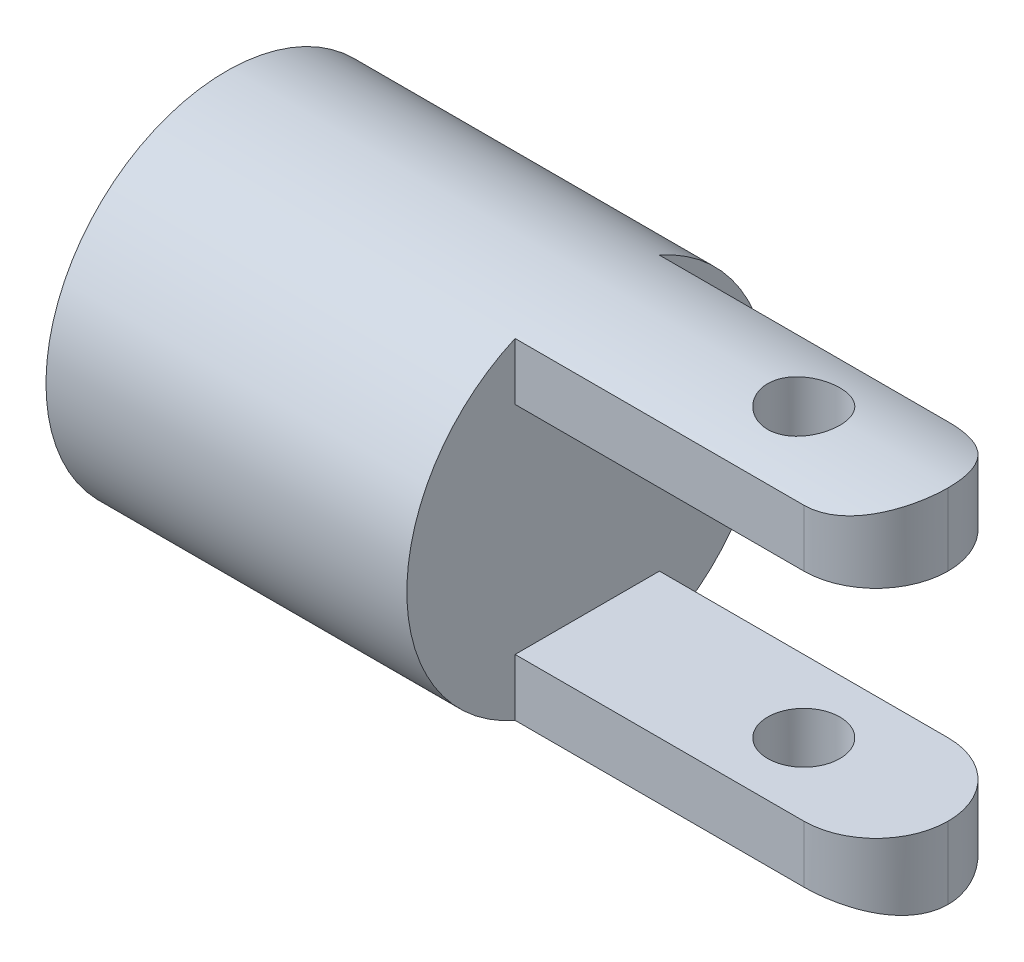
ISO-10303-21;
HEADER;
FILE_DESCRIPTION(('STEP AP214'),'2;1');
FILE_NAME('part.step','',(''),(''),'','','');
FILE_SCHEMA(('AUTOMOTIVE_DESIGN { 1 0 10303 214 1 1 1 1 }'));
ENDSEC;
DATA;
#1=APPLICATION_CONTEXT('core data for automotive mechanical design processes');
#2=APPLICATION_PROTOCOL_DEFINITION('international standard','automotive_design',2000,#1);
#3=PRODUCT_CONTEXT('',#1,'mechanical');
#4=PRODUCT('Part','Part','',(#3));
#5=PRODUCT_RELATED_PRODUCT_CATEGORY('part','',(#4));
#6=PRODUCT_DEFINITION_FORMATION('','',#4);
#7=PRODUCT_DEFINITION_CONTEXT('part definition',#1,'design');
#8=PRODUCT_DEFINITION('design','',#6,#7);
#9=PRODUCT_DEFINITION_SHAPE('','',#8);
#10=(LENGTH_UNIT() NAMED_UNIT(*) SI_UNIT(.MILLI.,.METRE.));
#11=(NAMED_UNIT(*) PLANE_ANGLE_UNIT() SI_UNIT($,.RADIAN.));
#12=(NAMED_UNIT(*) SI_UNIT($,.STERADIAN.) SOLID_ANGLE_UNIT());
#13=UNCERTAINTY_MEASURE_WITH_UNIT(LENGTH_MEASURE(1.E-05),#10,'distance_accuracy_value','');
#14=(GEOMETRIC_REPRESENTATION_CONTEXT(3) GLOBAL_UNCERTAINTY_ASSIGNED_CONTEXT((#13)) GLOBAL_UNIT_ASSIGNED_CONTEXT((#10,
#11,#12)) REPRESENTATION_CONTEXT('',''));
#15=CARTESIAN_POINT('',(0.,0.,0.));
#16=DIRECTION('',(0.,0.,1.));
#17=DIRECTION('',(1.,0.,0.));
#18=AXIS2_PLACEMENT_3D('',#15,#16,#17);
#19=CARTESIAN_POINT('',(10.,0.,0.));
#20=DIRECTION('',(-1.,0.,0.));
#21=DIRECTION('',(0.,0.,1.));
#22=AXIS2_PLACEMENT_3D('',#19,#20,#21);
#23=CYLINDRICAL_SURFACE('',#22,5.);
#24=CARTESIAN_POINT('',(6.,-4.89897948556636,1.));
#25=CARTESIAN_POINT('',(6.05556437548198,-4.89898059043933,0.999997945876046));
#26=CARTESIAN_POINT('',(6.11115462330649,-4.89993508346913,0.995353171723657));
#27=CARTESIAN_POINT('',(6.22076250511841,-4.90364431385263,0.976912283588336));
#28=CARTESIAN_POINT('',(6.27477884463107,-4.90640049166333,0.963108847071182));
#29=CARTESIAN_POINT('',(6.37963730336293,-4.91338873700356,0.926795782617738));
#30=CARTESIAN_POINT('',(6.43048252153493,-4.91761933615313,0.904294814152083));
#31=CARTESIAN_POINT('',(6.52767484469462,-4.92707799486421,0.851249107671044));
#32=CARTESIAN_POINT('',(6.57402220053727,-4.93230599875014,0.820704818601296));
#33=CARTESIAN_POINT('',(6.6615610038545,-4.9432529969268,0.75197907565329));
#34=CARTESIAN_POINT('',(6.70267958788414,-4.94897737836825,0.713705655913279));
#35=CARTESIAN_POINT('',(6.77795753357881,-4.9602247230302,0.63080678902135));
#36=CARTESIAN_POINT('',(6.81211640741715,-4.96574767210945,0.586180896977995));
#37=CARTESIAN_POINT('',(6.87278801762851,-4.97602796417448,0.491361355924245));
#38=CARTESIAN_POINT('',(6.89923151381665,-4.9807782144152,0.441122567672208));
#39=CARTESIAN_POINT('',(6.94327493704813,-4.98891736883662,0.336804150387275));
#40=CARTESIAN_POINT('',(6.96087569190099,-4.99230640044127,0.282724881420554));
#41=CARTESIAN_POINT('',(6.98650719361963,-4.9973032068841,0.173016773278493));
#42=CARTESIAN_POINT('',(6.99466097757101,-4.99893386288125,0.117417739214814));
#43=CARTESIAN_POINT('',(7.00155095183832,-5.00030921183606,0.00561856843753658));
#44=CARTESIAN_POINT('',(7.00028804964582,-5.00005408652759,-0.050581509831843));
#45=CARTESIAN_POINT('',(6.98847381978445,-4.99770434868515,-0.161142000743589));
#46=CARTESIAN_POINT('',(6.97805502283215,-4.99563598365838,-0.21551721429847));
#47=CARTESIAN_POINT('',(6.94843496754111,-4.98992177159409,-0.321731626580301));
#48=CARTESIAN_POINT('',(6.92923335780813,-4.98627586144039,-0.373570723747129));
#49=CARTESIAN_POINT('',(6.88246995985273,-4.97777296019958,-0.473619463200888));
#50=CARTESIAN_POINT('',(6.85485624889511,-4.97290848175223,-0.5218041741339));
#51=CARTESIAN_POINT('',(6.7920909227634,-4.96250469473785,-0.612905045859756));
#52=CARTESIAN_POINT('',(6.75693844022948,-4.95696530855222,-0.655820599525001));
#53=CARTESIAN_POINT('',(6.67936637789153,-4.9457096436446,-0.735951431053458));
#54=CARTESIAN_POINT('',(6.63683081327041,-4.93999196457516,-0.773054316573632));
#55=CARTESIAN_POINT('',(6.54608355754925,-4.92911571598761,-0.839618493176808));
#56=CARTESIAN_POINT('',(6.4978717591168,-4.92395715704548,-0.869079639727751));
#57=CARTESIAN_POINT('',(6.39697916817819,-4.91478047472924,-0.919562814801882));
#58=CARTESIAN_POINT('',(6.34428903236034,-4.91076481563549,-0.94056664777771));
#59=CARTESIAN_POINT('',(6.23602867627601,-4.90436476321273,-0.973390341627583));
#60=CARTESIAN_POINT('',(6.18045883238092,-4.90198015728428,-0.985211399456643));
#61=CARTESIAN_POINT('',(6.06903514200096,-4.89915479267828,-0.999166006036052));
#62=CARTESIAN_POINT('',(6.01320242568966,-4.89868147057154,-1.00146185889791));
#63=CARTESIAN_POINT('',(5.90195177680032,-4.89964485688854,-0.996737628310739));
#64=CARTESIAN_POINT('',(5.84653382088114,-4.90108145700388,-0.989718073122443));
#65=CARTESIAN_POINT('',(5.73823135970776,-4.90567232494914,-0.966702208074158));
#66=CARTESIAN_POINT('',(5.68532765696424,-4.90880999014497,-0.950792620839299));
#67=CARTESIAN_POINT('',(5.58293672097126,-4.91643489351665,-0.910541035308518));
#68=CARTESIAN_POINT('',(5.53344976956428,-4.9209222428627,-0.886198342373178));
#69=CARTESIAN_POINT('',(5.43858689004984,-4.93081405962039,-0.829404142215599));
#70=CARTESIAN_POINT('',(5.39327295369917,-4.93622971864903,-0.796851077982755));
#71=CARTESIAN_POINT('',(5.30869168799908,-4.94733723826636,-0.724695572212713));
#72=CARTESIAN_POINT('',(5.26942498175074,-4.95302912723818,-0.685092405144538));
#73=CARTESIAN_POINT('',(5.19743744081442,-4.96415345869216,-0.599232273497891));
#74=CARTESIAN_POINT('',(5.16482634535,-4.96958057708684,-0.55288249892963));
#75=CARTESIAN_POINT('',(5.10785411850042,-4.9794712762862,-0.455267896634756));
#76=CARTESIAN_POINT('',(5.08349264065522,-4.98393489755211,-0.404003275433507));
#77=CARTESIAN_POINT('',(5.04387112825337,-4.99137294061067,-0.298302680824013));
#78=CARTESIAN_POINT('',(5.02855948177375,-4.99435579142604,-0.243886673478078));
#79=CARTESIAN_POINT('',(5.00730875233615,-4.9985323593766,-0.133189454679912));
#80=CARTESIAN_POINT('',(5.00136854052432,-4.99972629199843,-0.0769084687112141));
#81=CARTESIAN_POINT('',(4.99907301903711,-5.00018540454121,0.0348728939036233));
#82=CARTESIAN_POINT('',(5.00255271954379,-4.99948378549351,0.0903698121415024));
#83=CARTESIAN_POINT('',(5.01863395054781,-4.99630043560318,0.199971031315642));
#84=CARTESIAN_POINT('',(5.03123536634807,-4.99381872714351,0.254075349753691));
#85=CARTESIAN_POINT('',(5.06512899209164,-4.98735498365001,0.359252749745096));
#86=CARTESIAN_POINT('',(5.08640137813118,-4.98337637247912,0.410332443240281));
#87=CARTESIAN_POINT('',(5.1370122413309,-4.97434722123382,0.508221220185953));
#88=CARTESIAN_POINT('',(5.16635135590372,-4.96929659645878,0.555029965767411));
#89=CARTESIAN_POINT('',(5.23281938706208,-4.95857599157868,0.643863890106357));
#90=CARTESIAN_POINT('',(5.27006633638677,-4.95289733422142,0.685799716116503));
#91=CARTESIAN_POINT('',(5.35105024009577,-4.94161222903622,0.762882617756846));
#92=CARTESIAN_POINT('',(5.39478872946874,-4.93600579862875,0.798028083202712));
#93=CARTESIAN_POINT('',(5.48807931670018,-4.92543342749964,0.860892219455201));
#94=CARTESIAN_POINT('',(5.53768896116037,-4.92047503631328,0.888526814639767));
#95=CARTESIAN_POINT('',(5.64093277329969,-4.91185237184445,0.935024049287809));
#96=CARTESIAN_POINT('',(5.69456323869792,-4.90818692536957,0.953894645979291));
#97=CARTESIAN_POINT('',(5.79026245543657,-4.90329681128922,0.978669139854274));
#98=CARTESIAN_POINT('',(5.83178541951146,-4.90168784915661,0.986653898522986));
#99=CARTESIAN_POINT('',(5.91553395455364,-4.8995287845803,0.99732001796041));
#100=CARTESIAN_POINT('',(5.95775950124817,-4.89897864563277,1.00000156156206));
#101=CARTESIAN_POINT('',(6.,-4.89897948556636,1.));
#102=B_SPLINE_CURVE_WITH_KNOTS('',3,(#24,#25,#26,#27,#28,#29,#30,#31,#32,#33,#34,#35,#36,#37,
#38,#39,#40,#41,#42,#43,#44,#45,#46,#47,#48,#49,#50,#51,#52,#53,#54,#55,#56,#57,#58,#59,#60,#61,
#62,#63,#64,#65,#66,#67,#68,#69,#70,#71,#72,#73,#74,#75,#76,#77,#78,#79,#80,#81,#82,#83,#84,#85,
#86,#87,#88,#89,#90,#91,#92,#93,#94,#95,#96,#97,#98,#99,#100,#101),.UNSPECIFIED.,.T.,.F.,(4,2,2,
2,2,2,2,2,2,2,2,2,2,2,2,2,2,2,2,2,2,2,2,2,2,2,2,2,2,2,2,2,2,2,2,2,2,2,4),(0.,0.166538463856524,
0.333210239259265,0.499716497915554,0.666213464834832,0.834822525459335,1.00344340032919,
1.17353400434947,1.34360868244057,1.51144248880577,1.67926012113745,1.84468789631034,
2.01012229071247,2.176599242198,2.34309535767563,2.5124934675998,2.68189478120217,
2.85165863170274,3.02140035013522,3.18823757802091,3.35506534525919,3.52029341780816,
3.68553510351895,3.85293059772018,4.02034332867706,4.19032601730948,4.36030156627602,
4.52929813576147,4.69827434689125,4.86431017412183,5.03034391364254,5.19600017072949,
5.36166952132181,5.53001152023094,5.69839338887278,5.86858898576538,6.0386297508643,
6.16523803634393,6.29184195681712),.UNSPECIFIED.);
#103=CARTESIAN_POINT('',(6.,-4.89897948556636,1.));
#104=VERTEX_POINT('',#103);
#105=EDGE_CURVE('E167',#104,#104,#102,.T.);
#106=ORIENTED_EDGE('',*,*,#105,.T.);
#107=EDGE_LOOP('',(#106));
#108=FACE_BOUND('',#107,.T.);
#109=CARTESIAN_POINT('',(6.,4.89897948556636,1.));
#110=CARTESIAN_POINT('',(5.94443562451802,4.89898059043933,0.999997945876046));
#111=CARTESIAN_POINT('',(5.88884537669351,4.89993508346913,0.995353171723657));
#112=CARTESIAN_POINT('',(5.77923749488159,4.90364431385263,0.976912283588336));
#113=CARTESIAN_POINT('',(5.72522115536893,4.90640049166333,0.963108847071182));
#114=CARTESIAN_POINT('',(5.62036269663707,4.91338873700356,0.926795782617738));
#115=CARTESIAN_POINT('',(5.56951747846507,4.91761933615313,0.904294814152083));
#116=CARTESIAN_POINT('',(5.47232515530538,4.92707799486421,0.851249107671044));
#117=CARTESIAN_POINT('',(5.42597779946273,4.93230599875014,0.820704818601296));
#118=CARTESIAN_POINT('',(5.3384389961455,4.9432529969268,0.75197907565329));
#119=CARTESIAN_POINT('',(5.29732041211586,4.94897737836825,0.713705655913279));
#120=CARTESIAN_POINT('',(5.22204246642119,4.9602247230302,0.63080678902135));
#121=CARTESIAN_POINT('',(5.18788359258285,4.96574767210945,0.586180896977995));
#122=CARTESIAN_POINT('',(5.12721198237149,4.97602796417448,0.491361355924245));
#123=CARTESIAN_POINT('',(5.10076848618335,4.9807782144152,0.441122567672208));
#124=CARTESIAN_POINT('',(5.05672506295187,4.98891736883662,0.336804150387275));
#125=CARTESIAN_POINT('',(5.03912430809901,4.99230640044127,0.282724881420554));
#126=CARTESIAN_POINT('',(5.01349280638037,4.9973032068841,0.173016773278494));
#127=CARTESIAN_POINT('',(5.00533902242899,4.99893386288125,0.117417739214814));
#128=CARTESIAN_POINT('',(4.99844904816169,5.00030921183606,0.00561856843753661));
#129=CARTESIAN_POINT('',(4.99971195035418,5.00005408652759,-0.050581509831843));
#130=CARTESIAN_POINT('',(5.01152618021555,4.99770434868515,-0.161142000743589));
#131=CARTESIAN_POINT('',(5.02194497716785,4.99563598365838,-0.21551721429847));
#132=CARTESIAN_POINT('',(5.05156503245889,4.98992177159409,-0.321731626580301));
#133=CARTESIAN_POINT('',(5.07076664219187,4.98627586144039,-0.373570723747129));
#134=CARTESIAN_POINT('',(5.11753004014727,4.97777296019958,-0.473619463200888));
#135=CARTESIAN_POINT('',(5.14514375110489,4.97290848175223,-0.5218041741339));
#136=CARTESIAN_POINT('',(5.2079090772366,4.96250469473785,-0.612905045859756));
#137=CARTESIAN_POINT('',(5.24306155977052,4.95696530855222,-0.655820599525001));
#138=CARTESIAN_POINT('',(5.32063362210847,4.9457096436446,-0.735951431053458));
#139=CARTESIAN_POINT('',(5.36316918672959,4.93999196457516,-0.773054316573632));
#140=CARTESIAN_POINT('',(5.45391644245075,4.92911571598761,-0.839618493176808));
#141=CARTESIAN_POINT('',(5.5021282408832,4.92395715704548,-0.869079639727751));
#142=CARTESIAN_POINT('',(5.60302083182181,4.91478047472924,-0.919562814801882));
#143=CARTESIAN_POINT('',(5.65571096763966,4.91076481563549,-0.94056664777771));
#144=CARTESIAN_POINT('',(5.76397132372399,4.90436476321273,-0.973390341627583));
#145=CARTESIAN_POINT('',(5.81954116761908,4.90198015728428,-0.985211399456643));
#146=CARTESIAN_POINT('',(5.93096485799904,4.89915479267828,-0.999166006036052));
#147=CARTESIAN_POINT('',(5.98679757431034,4.89868147057154,-1.00146185889791));
#148=CARTESIAN_POINT('',(6.09804822319968,4.89964485688854,-0.996737628310739));
#149=CARTESIAN_POINT('',(6.15346617911886,4.90108145700388,-0.989718073122443));
#150=CARTESIAN_POINT('',(6.26176864029224,4.90567232494914,-0.966702208074158));
#151=CARTESIAN_POINT('',(6.31467234303576,4.90880999014497,-0.950792620839299));
#152=CARTESIAN_POINT('',(6.41706327902874,4.91643489351665,-0.910541035308518));
#153=CARTESIAN_POINT('',(6.46655023043572,4.9209222428627,-0.886198342373178));
#154=CARTESIAN_POINT('',(6.56141310995016,4.93081405962039,-0.829404142215599));
#155=CARTESIAN_POINT('',(6.60672704630083,4.93622971864903,-0.796851077982755));
#156=CARTESIAN_POINT('',(6.69130831200092,4.94733723826636,-0.724695572212713));
#157=CARTESIAN_POINT('',(6.73057501824926,4.95302912723818,-0.685092405144538));
#158=CARTESIAN_POINT('',(6.80256255918558,4.96415345869216,-0.599232273497891));
#159=CARTESIAN_POINT('',(6.83517365465,4.96958057708684,-0.55288249892963));
#160=CARTESIAN_POINT('',(6.89214588149958,4.9794712762862,-0.455267896634755));
#161=CARTESIAN_POINT('',(6.91650735934478,4.98393489755211,-0.404003275433507));
#162=CARTESIAN_POINT('',(6.95612887174663,4.99137294061067,-0.298302680824013));
#163=CARTESIAN_POINT('',(6.97144051822625,4.99435579142604,-0.243886673478078));
#164=CARTESIAN_POINT('',(6.99269124766385,4.9985323593766,-0.133189454679912));
#165=CARTESIAN_POINT('',(6.99863145947568,4.99972629199843,-0.0769084687112142));
#166=CARTESIAN_POINT('',(7.00092698096289,5.00018540454121,0.0348728939036233));
#167=CARTESIAN_POINT('',(6.99744728045621,4.99948378549351,0.0903698121415024));
#168=CARTESIAN_POINT('',(6.98136604945219,4.99630043560318,0.199971031315642));
#169=CARTESIAN_POINT('',(6.96876463365193,4.99381872714351,0.254075349753691));
#170=CARTESIAN_POINT('',(6.93487100790836,4.98735498365001,0.359252749745096));
#171=CARTESIAN_POINT('',(6.91359862186882,4.98337637247912,0.410332443240281));
#172=CARTESIAN_POINT('',(6.8629877586691,4.97434722123382,0.508221220185953));
#173=CARTESIAN_POINT('',(6.83364864409628,4.96929659645878,0.555029965767411));
#174=CARTESIAN_POINT('',(6.76718061293792,4.95857599157868,0.643863890106357));
#175=CARTESIAN_POINT('',(6.72993366361323,4.95289733422142,0.685799716116503));
#176=CARTESIAN_POINT('',(6.64894975990423,4.94161222903622,0.762882617756846));
#177=CARTESIAN_POINT('',(6.60521127053126,4.93600579862875,0.798028083202712));
#178=CARTESIAN_POINT('',(6.51192068329982,4.92543342749964,0.8608922194552));
#179=CARTESIAN_POINT('',(6.46231103883964,4.92047503631328,0.888526814639767));
#180=CARTESIAN_POINT('',(6.35906722670031,4.91185237184445,0.935024049287809));
#181=CARTESIAN_POINT('',(6.30543676130208,4.90818692536957,0.95389464597929));
#182=CARTESIAN_POINT('',(6.20973754456343,4.90329681128922,0.978669139854274));
#183=CARTESIAN_POINT('',(6.16821458048855,4.90168784915661,0.986653898522986));
#184=CARTESIAN_POINT('',(6.08446604544636,4.8995287845803,0.99732001796041));
#185=CARTESIAN_POINT('',(6.04224049875183,4.89897864563277,1.00000156156206));
#186=CARTESIAN_POINT('',(6.,4.89897948556636,1.));
#187=B_SPLINE_CURVE_WITH_KNOTS('',3,(#109,#110,#111,#112,#113,#114,#115,#116,#117,#118,#119,
#120,#121,#122,#123,#124,#125,#126,#127,#128,#129,#130,#131,#132,#133,#134,#135,#136,#137,#138,
#139,#140,#141,#142,#143,#144,#145,#146,#147,#148,#149,#150,#151,#152,#153,#154,#155,#156,#157,
#158,#159,#160,#161,#162,#163,#164,#165,#166,#167,#168,#169,#170,#171,#172,#173,#174,#175,#176,
#177,#178,#179,#180,#181,#182,#183,#184,#185,#186),.UNSPECIFIED.,.T.,.F.,(4,2,2,2,2,2,2,2,2,2,2,
2,2,2,2,2,2,2,2,2,2,2,2,2,2,2,2,2,2,2,2,2,2,2,2,2,2,2,4),(0.,0.166538463856524,
0.333210239259265,0.499716497915554,0.666213464834832,0.834822525459335,1.00344340032919,
1.17353400434947,1.34360868244057,1.51144248880577,1.67926012113745,1.84468789631034,
2.01012229071247,2.176599242198,2.34309535767563,2.5124934675998,2.68189478120217,
2.85165863170274,3.02140035013522,3.18823757802091,3.35506534525919,3.52029341780816,
3.68553510351895,3.85293059772018,4.02034332867706,4.19032601730948,4.36030156627602,
4.52929813576147,4.69827434689125,4.86431017412183,5.03034391364254,5.19600017072949,
5.36166952132181,5.53001152023094,5.69839338887278,5.86858898576538,6.0386297508643,
6.16523803634393,6.29184195681712),.UNSPECIFIED.);
#188=CARTESIAN_POINT('',(6.,4.89897948556636,1.));
#189=VERTEX_POINT('',#188);
#190=EDGE_CURVE('E160',#189,#189,#187,.T.);
#191=ORIENTED_EDGE('',*,*,#190,.T.);
#192=EDGE_LOOP('',(#191));
#193=FACE_BOUND('',#192,.T.);
#194=DIRECTION('',(-1.,0.,0.));
#195=VECTOR('',#194,1.);
#196=CARTESIAN_POINT('',(10.,-4.58257569495584,-2.));
#197=LINE('',#196,#195);
#198=CARTESIAN_POINT('',(0.,-4.58257569495584,-2.));
#199=VERTEX_POINT('',#198);
#200=CARTESIAN_POINT('',(8.,-4.58257569495584,-2.));
#201=VERTEX_POINT('',#200);
#202=EDGE_CURVE('E152',#199,#201,#197,.F.);
#203=ORIENTED_EDGE('',*,*,#202,.T.);
#204=CARTESIAN_POINT('',(8.,-4.58257569495584,-2.));
#205=CARTESIAN_POINT('',(8.05380794672207,-4.58256464275298,-2.00000798226547));
#206=CARTESIAN_POINT('',(8.10760985512743,-4.58352313442188,-1.99782874490323));
#207=CARTESIAN_POINT('',(8.21477962167183,-4.5872966203973,-1.98915821670635));
#208=CARTESIAN_POINT('',(8.26814763735034,-4.5901109073494,-1.98266856881979));
#209=CARTESIAN_POINT('',(8.37385705447567,-4.59749868539403,-1.96547403396094));
#210=CARTESIAN_POINT('',(8.42620171249594,-4.60206508273537,-1.95478614029394));
#211=CARTESIAN_POINT('',(8.52970476915836,-4.61280101528185,-1.92931514556297));
#212=CARTESIAN_POINT('',(8.58086309526334,-4.6189706482353,-1.91453179479781));
#213=CARTESIAN_POINT('',(8.73193384815239,-4.63959263808194,-1.86427039137914));
#214=CARTESIAN_POINT('',(8.82965033430428,-4.65617382537423,-1.82284658382869));
#215=CARTESIAN_POINT('',(9.01679203128369,-4.69312290325746,-1.72548410131523));
#216=CARTESIAN_POINT('',(9.10620891287759,-4.71349453753741,-1.66953105454032));
#217=CARTESIAN_POINT('',(9.27926132355672,-4.75700971229099,-1.5413192827261));
#218=CARTESIAN_POINT('',(9.36236512614559,-4.78024183177243,-1.46837145068181));
#219=CARTESIAN_POINT('',(9.51553876313595,-4.82612745066481,-1.30969788005014));
#220=CARTESIAN_POINT('',(9.58560561543521,-4.84878081667053,-1.22396922600595));
#221=CARTESIAN_POINT('',(9.71342935616949,-4.89204182066139,-1.03797402696559));
#222=CARTESIAN_POINT('',(9.77058398128806,-4.91253186687149,-0.937264095137756));
#223=CARTESIAN_POINT('',(9.86687467110571,-4.94805155705439,-0.726735487214705));
#224=CARTESIAN_POINT('',(9.90603118484789,-4.96308739385852,-0.616927316658774));
#225=CARTESIAN_POINT('',(9.95673922691488,-4.98281366909797,-0.422308681432875));
#226=CARTESIAN_POINT('',(9.97290672820058,-4.98920714607479,-0.338847141215359));
#227=CARTESIAN_POINT('',(9.99455968296722,-4.9978239365109,-0.170279893555539));
#228=CARTESIAN_POINT('',(10.0000371714556,-5.00004414047217,-0.085173007830922));
#229=CARTESIAN_POINT('',(10.,-5.,0.));
#230=B_SPLINE_CURVE_WITH_KNOTS('',3,(#204,#205,#206,#207,#208,#209,#210,#211,#212,#213,#214,
#215,#216,#217,#218,#219,#220,#221,#222,#223,#224,#225,#226,#227,#228,#229),.UNSPECIFIED.,.F.,
.F.,(4,2,2,2,2,2,2,2,2,2,2,2,4),(0.,0.161361132218348,0.322660795595021,0.483314182470726,
0.643977366585654,0.964676637786452,1.28569434990803,1.62317652692535,1.96073580574917,
2.31175518758891,2.6623747573584,2.91738155220578,3.17257827694264),.UNSPECIFIED.);
#231=CARTESIAN_POINT('',(10.,-5.,0.));
#232=VERTEX_POINT('',#231);
#233=EDGE_CURVE('E248',#201,#232,#230,.T.);
#234=ORIENTED_EDGE('',*,*,#233,.T.);
#235=CARTESIAN_POINT('',(10.,-5.,0.));
#236=CARTESIAN_POINT('',(10.0000075778829,-5.00000805896568,0.0539825664563211));
#237=CARTESIAN_POINT('',(9.99781459055665,-4.99912596417449,0.107960110320674));
#238=CARTESIAN_POINT('',(9.98908634175755,-4.9956416195171,0.215491525692988));
#239=CARTESIAN_POINT('',(9.98255236713993,-4.99303987942887,0.269045518000412));
#240=CARTESIAN_POINT('',(9.96523130012006,-4.98618834146238,0.375162640014686));
#241=CARTESIAN_POINT('',(9.95445917326855,-4.98194434350163,0.427728581646533));
#242=CARTESIAN_POINT('',(9.92877901672999,-4.97192620219359,0.531678089194856));
#243=CARTESIAN_POINT('',(9.91387082146321,-4.96615199758777,0.583061607686043));
#244=CARTESIAN_POINT('',(9.86315734027571,-4.94675280678146,0.734842037962944));
#245=CARTESIAN_POINT('',(9.82133521708571,-4.93103965584297,0.833037602437025));
#246=CARTESIAN_POINT('',(9.72303888046503,-4.89558681296197,1.02098836831291));
#247=CARTESIAN_POINT('',(9.66655370578164,-4.87584411112944,1.11073718673261));
#248=CARTESIAN_POINT('',(9.53776410630983,-4.83330860764966,1.2834989710368));
#249=CARTESIAN_POINT('',(9.46489060274242,-4.8104219882134,1.36606513383557));
#250=CARTESIAN_POINT('',(9.30659481549411,-4.76460445713638,1.51817975582642));
#251=CARTESIAN_POINT('',(9.22116705158954,-4.74167353049049,1.58772249969095));
#252=CARTESIAN_POINT('',(9.03553131361565,-4.69721798262516,1.71490322313788));
#253=CARTESIAN_POINT('',(8.93483118065825,-4.67580310017044,1.77186456014057));
#254=CARTESIAN_POINT('',(8.72435381541352,-4.63832030094516,1.86779273517168));
#255=CARTESIAN_POINT('',(8.61458934130171,-4.62224502353331,1.90678437340489));
#256=CARTESIAN_POINT('',(8.42039615622961,-4.60110694265762,1.95713070702437));
#257=CARTESIAN_POINT('',(8.33734865687763,-4.59422849336489,1.97314512573215));
#258=CARTESIAN_POINT('',(8.16956037832453,-4.58493031504587,1.99460528633617));
#259=CARTESIAN_POINT('',(8.08481771370095,-4.58251586581701,2.00003851372961));
#260=CARTESIAN_POINT('',(8.,-4.58257569495584,2.));
#261=B_SPLINE_CURVE_WITH_KNOTS('',3,(#235,#236,#237,#238,#239,#240,#241,#242,#243,#244,#245,
#246,#247,#248,#249,#250,#251,#252,#253,#254,#255,#256,#257,#258,#259,#260),.UNSPECIFIED.,.F.,
.F.,(4,2,2,2,2,2,2,2,2,2,2,2,4),(0.,0.161887516282227,0.323727063545161,0.485000187552343,
0.646279768757658,0.968331009877644,1.2906236947287,1.626578356582,1.96268010840895,
2.31390836587329,2.66465042644721,2.91846381435153,3.17257720854796),.UNSPECIFIED.);
#262=CARTESIAN_POINT('',(8.,-4.58257569495584,2.));
#263=VERTEX_POINT('',#262);
#264=EDGE_CURVE('E118',#232,#263,#261,.T.);
#265=ORIENTED_EDGE('',*,*,#264,.T.);
#266=DIRECTION('',(-1.,0.,0.));
#267=VECTOR('',#266,1.);
#268=CARTESIAN_POINT('',(10.,-4.58257569495584,2.));
#269=LINE('',#268,#267);
#270=CARTESIAN_POINT('',(0.,-4.58257569495584,2.));
#271=VERTEX_POINT('',#270);
#272=EDGE_CURVE('E110',#263,#271,#269,.T.);
#273=ORIENTED_EDGE('',*,*,#272,.T.);
#274=CARTESIAN_POINT('',(0.,0.,0.));
#275=DIRECTION('',(-1.,0.,0.));
#276=DIRECTION('',(0.,0.,1.));
#277=AXIS2_PLACEMENT_3D('',#274,#275,#276);
#278=CIRCLE('',#277,5.);
#279=CARTESIAN_POINT('',(0.,4.58257569495584,2.));
#280=VERTEX_POINT('',#279);
#281=EDGE_CURVE('E115',#271,#280,#278,.T.);
#282=ORIENTED_EDGE('',*,*,#281,.T.);
#283=DIRECTION('',(-1.,0.,0.));
#284=VECTOR('',#283,1.);
#285=CARTESIAN_POINT('',(10.,4.58257569495584,2.));
#286=LINE('',#285,#284);
#287=CARTESIAN_POINT('',(8.,4.58257569495584,2.));
#288=VERTEX_POINT('',#287);
#289=EDGE_CURVE('E123',#280,#288,#286,.F.);
#290=ORIENTED_EDGE('',*,*,#289,.T.);
#291=CARTESIAN_POINT('',(8.,4.58257569495584,2.));
#292=CARTESIAN_POINT('',(8.05380794672207,4.58256464275298,2.00000798226547));
#293=CARTESIAN_POINT('',(8.10760985512743,4.58352313442188,1.99782874490323));
#294=CARTESIAN_POINT('',(8.21477962167183,4.5872966203973,1.98915821670635));
#295=CARTESIAN_POINT('',(8.26814763735034,4.5901109073494,1.98266856881979));
#296=CARTESIAN_POINT('',(8.37385705447567,4.59749868539403,1.96547403396094));
#297=CARTESIAN_POINT('',(8.42620171249594,4.60206508273537,1.95478614029394));
#298=CARTESIAN_POINT('',(8.52970476915836,4.61280101528185,1.92931514556297));
#299=CARTESIAN_POINT('',(8.58086309526334,4.6189706482353,1.91453179479781));
#300=CARTESIAN_POINT('',(8.73193384815239,4.63959263808194,1.86427039137914));
#301=CARTESIAN_POINT('',(8.82965033430428,4.65617382537423,1.82284658382869));
#302=CARTESIAN_POINT('',(9.01679203128369,4.69312290325746,1.72548410131523));
#303=CARTESIAN_POINT('',(9.10620891287759,4.71349453753741,1.66953105454032));
#304=CARTESIAN_POINT('',(9.27926132355672,4.75700971229099,1.5413192827261));
#305=CARTESIAN_POINT('',(9.36236512614559,4.78024183177243,1.4683714506818));
#306=CARTESIAN_POINT('',(9.51553876313595,4.82612745066481,1.30969788005014));
#307=CARTESIAN_POINT('',(9.58560561543521,4.84878081667053,1.22396922600595));
#308=CARTESIAN_POINT('',(9.71342935616949,4.89204182066139,1.03797402696559));
#309=CARTESIAN_POINT('',(9.77058398128806,4.91253186687149,0.937264095137755));
#310=CARTESIAN_POINT('',(9.86687467110571,4.94805155705439,0.726735487214705));
#311=CARTESIAN_POINT('',(9.90603118484789,4.96308739385852,0.616927316658773));
#312=CARTESIAN_POINT('',(9.95673922691488,4.98281366909797,0.422308681432875));
#313=CARTESIAN_POINT('',(9.97290672820058,4.98920714607479,0.338847141215358));
#314=CARTESIAN_POINT('',(9.99455968296722,4.9978239365109,0.170279893555539));
#315=CARTESIAN_POINT('',(10.0000371714556,5.00004414047217,0.0851730078309217));
#316=CARTESIAN_POINT('',(10.,5.,0.));
#317=B_SPLINE_CURVE_WITH_KNOTS('',3,(#291,#292,#293,#294,#295,#296,#297,#298,#299,#300,#301,
#302,#303,#304,#305,#306,#307,#308,#309,#310,#311,#312,#313,#314,#315,#316),.UNSPECIFIED.,.F.,
.F.,(4,2,2,2,2,2,2,2,2,2,2,2,4),(0.,0.161361132218348,0.322660795595021,0.483314182470726,
0.643977366585654,0.964676637786453,1.28569434990803,1.62317652692535,1.96073580574917,
2.31175518758891,2.6623747573584,2.91738155220578,3.17257827694264),.UNSPECIFIED.);
#318=CARTESIAN_POINT('',(10.,5.,0.));
#319=VERTEX_POINT('',#318);
#320=EDGE_CURVE('E220',#288,#319,#317,.T.);
#321=ORIENTED_EDGE('',*,*,#320,.T.);
#322=CARTESIAN_POINT('',(10.,5.,0.));
#323=CARTESIAN_POINT('',(10.0000075778829,5.00000805896568,-0.0539825664563218));
#324=CARTESIAN_POINT('',(9.99781459055665,4.99912596417449,-0.107960110320674));
#325=CARTESIAN_POINT('',(9.98908634175755,4.9956416195171,-0.215491525692989));
#326=CARTESIAN_POINT('',(9.98255236713993,4.99303987942887,-0.269045518000412));
#327=CARTESIAN_POINT('',(9.96523130012006,4.98618834146238,-0.375162640014687));
#328=CARTESIAN_POINT('',(9.95445917326855,4.98194434350163,-0.427728581646533));
#329=CARTESIAN_POINT('',(9.92877901672999,4.97192620219359,-0.531678089194856));
#330=CARTESIAN_POINT('',(9.91387082146321,4.96615199758777,-0.583061607686044));
#331=CARTESIAN_POINT('',(9.86315734027571,4.94675280678146,-0.734842037962944));
#332=CARTESIAN_POINT('',(9.82133521708571,4.93103965584297,-0.833037602437026));
#333=CARTESIAN_POINT('',(9.72303888046503,4.89558681296197,-1.02098836831291));
#334=CARTESIAN_POINT('',(9.66655370578164,4.87584411112944,-1.11073718673261));
#335=CARTESIAN_POINT('',(9.53776410630983,4.83330860764966,-1.2834989710368));
#336=CARTESIAN_POINT('',(9.46489060274242,4.8104219882134,-1.36606513383557));
#337=CARTESIAN_POINT('',(9.30659481549411,4.76460445713637,-1.51817975582642));
#338=CARTESIAN_POINT('',(9.22116705158954,4.74167353049049,-1.58772249969095));
#339=CARTESIAN_POINT('',(9.03553131361565,4.69721798262516,-1.71490322313788));
#340=CARTESIAN_POINT('',(8.93483118065825,4.67580310017044,-1.77186456014057));
#341=CARTESIAN_POINT('',(8.72435381541352,4.63832030094516,-1.86779273517168));
#342=CARTESIAN_POINT('',(8.61458934130171,4.6222450235333,-1.90678437340489));
#343=CARTESIAN_POINT('',(8.42039615622961,4.60110694265762,-1.95713070702437));
#344=CARTESIAN_POINT('',(8.33734865687763,4.59422849336489,-1.97314512573215));
#345=CARTESIAN_POINT('',(8.16956037832453,4.58493031504587,-1.99460528633617));
#346=CARTESIAN_POINT('',(8.08481771370095,4.58251586581702,-2.00003851372961));
#347=CARTESIAN_POINT('',(8.,4.58257569495584,-2.));
#348=B_SPLINE_CURVE_WITH_KNOTS('',3,(#322,#323,#324,#325,#326,#327,#328,#329,#330,#331,#332,
#333,#334,#335,#336,#337,#338,#339,#340,#341,#342,#343,#344,#345,#346,#347),.UNSPECIFIED.,.F.,
.F.,(4,2,2,2,2,2,2,2,2,2,2,2,4),(0.,0.161887516282227,0.323727063545161,0.485000187552343,
0.646279768757658,0.968331009877644,1.2906236947287,1.626578356582,1.96268010840895,
2.31390836587329,2.66465042644721,2.91846381435153,3.17257720854796),.UNSPECIFIED.);
#349=CARTESIAN_POINT('',(8.,4.58257569495584,-2.));
#350=VERTEX_POINT('',#349);
#351=EDGE_CURVE('E225',#319,#350,#348,.T.);
#352=ORIENTED_EDGE('',*,*,#351,.T.);
#353=DIRECTION('',(-1.,0.,0.));
#354=VECTOR('',#353,1.);
#355=CARTESIAN_POINT('',(10.,4.58257569495584,-2.));
#356=LINE('',#355,#354);
#357=CARTESIAN_POINT('',(0.,4.58257569495584,-2.));
#358=VERTEX_POINT('',#357);
#359=EDGE_CURVE('E154',#350,#358,#356,.T.);
#360=ORIENTED_EDGE('',*,*,#359,.T.);
#361=EDGE_CURVE('E135',#358,#199,#278,.T.);
#362=ORIENTED_EDGE('',*,*,#361,.T.);
#363=EDGE_LOOP('',(#203,#234,#265,#273,#282,#290,#321,#352,#360,#362));
#364=FACE_BOUND('',#363,.T.);
#365=CARTESIAN_POINT('',(-10.,0.,0.));
#366=DIRECTION('',(1.,0.,0.));
#367=DIRECTION('',(0.,0.,-1.));
#368=AXIS2_PLACEMENT_3D('',#365,#366,#367);
#369=CIRCLE('',#368,5.);
#370=CARTESIAN_POINT('',(-10.,0.,-5.));
#371=VERTEX_POINT('',#370);
#372=EDGE_CURVE('E136',#371,#371,#369,.T.);
#373=ORIENTED_EDGE('',*,*,#372,.T.);
#374=EDGE_LOOP('',(#373));
#375=FACE_BOUND('',#374,.T.);
#376=ADVANCED_FACE('F35',(#108,#193,#364,#375),#23,.T.);
#377=CARTESIAN_POINT('',(-10.,0.,0.));
#378=DIRECTION('',(1.,0.,0.));
#379=DIRECTION('',(0.,0.,-1.));
#380=AXIS2_PLACEMENT_3D('',#377,#378,#379);
#381=PLANE('',#380);
#382=ORIENTED_EDGE('',*,*,#372,.F.);
#383=EDGE_LOOP('',(#382));
#384=FACE_BOUND('',#383,.T.);
#385=ADVANCED_FACE('F193',(#384),#381,.F.);
#386=CARTESIAN_POINT('',(0.,3.,-5.));
#387=DIRECTION('',(-1.,0.,0.));
#388=DIRECTION('',(0.,0.,1.));
#389=AXIS2_PLACEMENT_3D('',#386,#387,#388);
#390=PLANE('',#389);
#391=DIRECTION('',(0.,0.,1.));
#392=VECTOR('',#391,1.);
#393=CARTESIAN_POINT('',(0.,3.,-5.));
#394=LINE('',#393,#392);
#395=CARTESIAN_POINT('',(0.,3.,-2.));
#396=VERTEX_POINT('',#395);
#397=CARTESIAN_POINT('',(0.,3.,2.));
#398=VERTEX_POINT('',#397);
#399=EDGE_CURVE('E203',#396,#398,#394,.T.);
#400=ORIENTED_EDGE('',*,*,#399,.T.);
#401=DIRECTION('',(0.,1.,0.));
#402=VECTOR('',#401,1.);
#403=CARTESIAN_POINT('',(0.,-5.,2.));
#404=LINE('',#403,#402);
#405=EDGE_CURVE('E134',#398,#280,#404,.T.);
#406=ORIENTED_EDGE('',*,*,#405,.T.);
#407=ORIENTED_EDGE('',*,*,#281,.F.);
#408=CARTESIAN_POINT('',(0.,-3.,2.));
#409=VERTEX_POINT('',#408);
#410=EDGE_CURVE('E131',#271,#409,#404,.T.);
#411=ORIENTED_EDGE('',*,*,#410,.T.);
#412=DIRECTION('',(0.,0.,1.));
#413=VECTOR('',#412,1.);
#414=CARTESIAN_POINT('',(0.,-3.,-5.));
#415=LINE('',#414,#413);
#416=CARTESIAN_POINT('',(0.,-3.,-2.));
#417=VERTEX_POINT('',#416);
#418=EDGE_CURVE('E205',#417,#409,#415,.T.);
#419=ORIENTED_EDGE('',*,*,#418,.F.);
#420=DIRECTION('',(0.,1.,0.));
#421=VECTOR('',#420,1.);
#422=CARTESIAN_POINT('',(0.,-5.,-2.));
#423=LINE('',#422,#421);
#424=EDGE_CURVE('E149',#199,#417,#423,.T.);
#425=ORIENTED_EDGE('',*,*,#424,.F.);
#426=ORIENTED_EDGE('',*,*,#361,.F.);
#427=EDGE_CURVE('E122',#396,#358,#423,.T.);
#428=ORIENTED_EDGE('',*,*,#427,.F.);
#429=EDGE_LOOP('',(#400,#406,#407,#411,#419,#425,#426,#428));
#430=FACE_BOUND('',#429,.T.);
#431=ADVANCED_FACE('F129',(#430),#390,.F.);
#432=CARTESIAN_POINT('',(0.,3.,-5.));
#433=DIRECTION('',(0.,1.,0.));
#434=DIRECTION('',(0.,0.,1.));
#435=AXIS2_PLACEMENT_3D('',#432,#433,#434);
#436=PLANE('',#435);
#437=CARTESIAN_POINT('',(6.,3.,0.));
#438=DIRECTION('',(0.,1.,0.));
#439=DIRECTION('',(0.,0.,1.));
#440=AXIS2_PLACEMENT_3D('',#437,#438,#439);
#441=CIRCLE('',#440,1.);
#442=CARTESIAN_POINT('',(6.,3.,1.));
#443=VERTEX_POINT('',#442);
#444=EDGE_CURVE('E157',#443,#443,#441,.T.);
#445=ORIENTED_EDGE('',*,*,#444,.T.);
#446=EDGE_LOOP('',(#445));
#447=FACE_BOUND('',#446,.T.);
#448=DIRECTION('',(1.,0.,0.));
#449=VECTOR('',#448,1.);
#450=CARTESIAN_POINT('',(0.,3.,-2.));
#451=LINE('',#450,#449);
#452=CARTESIAN_POINT('',(8.,3.,-2.));
#453=VERTEX_POINT('',#452);
#454=EDGE_CURVE('E150',#396,#453,#451,.T.);
#455=ORIENTED_EDGE('',*,*,#454,.T.);
#456=CARTESIAN_POINT('',(8.,3.,0.));
#457=DIRECTION('',(0.,1.,0.));
#458=DIRECTION('',(0.,0.,1.));
#459=AXIS2_PLACEMENT_3D('',#456,#457,#458);
#460=CIRCLE('',#459,2.);
#461=CARTESIAN_POINT('',(10.,3.,0.));
#462=VERTEX_POINT('',#461);
#463=EDGE_CURVE('E45',#453,#462,#460,.F.);
#464=ORIENTED_EDGE('',*,*,#463,.T.);
#465=CARTESIAN_POINT('',(8.,3.,0.));
#466=DIRECTION('',(0.,1.,0.));
#467=DIRECTION('',(0.,0.,1.));
#468=AXIS2_PLACEMENT_3D('',#465,#466,#467);
#469=CIRCLE('',#468,2.);
#470=CARTESIAN_POINT('',(8.,3.,2.));
#471=VERTEX_POINT('',#470);
#472=EDGE_CURVE('E53',#462,#471,#469,.F.);
#473=ORIENTED_EDGE('',*,*,#472,.T.);
#474=DIRECTION('',(-1.,0.,0.));
#475=VECTOR('',#474,1.);
#476=CARTESIAN_POINT('',(0.,3.,2.));
#477=LINE('',#476,#475);
#478=EDGE_CURVE('E141',#471,#398,#477,.T.);
#479=ORIENTED_EDGE('',*,*,#478,.T.);
#480=ORIENTED_EDGE('',*,*,#399,.F.);
#481=EDGE_LOOP('',(#455,#464,#473,#479,#480));
#482=FACE_BOUND('',#481,.T.);
#483=ADVANCED_FACE('F184',(#447,#482),#436,.F.);
#484=CARTESIAN_POINT('',(0.,-3.,-5.));
#485=DIRECTION('',(0.,-1.,0.));
#486=DIRECTION('',(0.,0.,-1.));
#487=AXIS2_PLACEMENT_3D('',#484,#485,#486);
#488=PLANE('',#487);
#489=CARTESIAN_POINT('',(6.,-3.,0.));
#490=DIRECTION('',(0.,-1.,0.));
#491=DIRECTION('',(0.,0.,-1.));
#492=AXIS2_PLACEMENT_3D('',#489,#490,#491);
#493=CIRCLE('',#492,1.);
#494=CARTESIAN_POINT('',(6.,-3.,-1.));
#495=VERTEX_POINT('',#494);
#496=EDGE_CURVE('E156',#495,#495,#493,.T.);
#497=ORIENTED_EDGE('',*,*,#496,.T.);
#498=EDGE_LOOP('',(#497));
#499=FACE_BOUND('',#498,.T.);
#500=CARTESIAN_POINT('',(8.,-3.,0.));
#501=DIRECTION('',(0.,-1.,0.));
#502=DIRECTION('',(0.,0.,-1.));
#503=AXIS2_PLACEMENT_3D('',#500,#501,#502);
#504=CIRCLE('',#503,2.);
#505=CARTESIAN_POINT('',(8.,-3.,2.));
#506=VERTEX_POINT('',#505);
#507=CARTESIAN_POINT('',(10.,-3.,0.));
#508=VERTEX_POINT('',#507);
#509=EDGE_CURVE('E213',#506,#508,#504,.F.);
#510=ORIENTED_EDGE('',*,*,#509,.T.);
#511=CARTESIAN_POINT('',(8.,-3.,0.));
#512=DIRECTION('',(0.,-1.,0.));
#513=DIRECTION('',(0.,0.,-1.));
#514=AXIS2_PLACEMENT_3D('',#511,#512,#513);
#515=CIRCLE('',#514,2.);
#516=CARTESIAN_POINT('',(8.,-3.,-2.));
#517=VERTEX_POINT('',#516);
#518=EDGE_CURVE('E215',#508,#517,#515,.F.);
#519=ORIENTED_EDGE('',*,*,#518,.T.);
#520=DIRECTION('',(-1.,0.,0.));
#521=VECTOR('',#520,1.);
#522=CARTESIAN_POINT('',(0.,-3.,-2.));
#523=LINE('',#522,#521);
#524=EDGE_CURVE('E210',#517,#417,#523,.T.);
#525=ORIENTED_EDGE('',*,*,#524,.T.);
#526=ORIENTED_EDGE('',*,*,#418,.T.);
#527=DIRECTION('',(1.,0.,0.));
#528=VECTOR('',#527,1.);
#529=CARTESIAN_POINT('',(0.,-3.,2.));
#530=LINE('',#529,#528);
#531=EDGE_CURVE('E140',#409,#506,#530,.T.);
#532=ORIENTED_EDGE('',*,*,#531,.T.);
#533=EDGE_LOOP('',(#510,#519,#525,#526,#532));
#534=FACE_BOUND('',#533,.T.);
#535=ADVANCED_FACE('F180',(#499,#534),#488,.F.);
#536=CARTESIAN_POINT('',(6.,-5.,0.));
#537=DIRECTION('',(0.,1.,0.));
#538=DIRECTION('',(0.,0.,1.));
#539=AXIS2_PLACEMENT_3D('',#536,#537,#538);
#540=CYLINDRICAL_SURFACE('',#539,1.);
#541=ORIENTED_EDGE('',*,*,#496,.F.);
#542=EDGE_LOOP('',(#541));
#543=FACE_BOUND('',#542,.T.);
#544=ORIENTED_EDGE('',*,*,#105,.F.);
#545=EDGE_LOOP('',(#544));
#546=FACE_BOUND('',#545,.T.);
#547=ADVANCED_FACE('F174',(#543,#546),#540,.F.);
#548=ORIENTED_EDGE('',*,*,#444,.F.);
#549=EDGE_LOOP('',(#548));
#550=FACE_BOUND('',#549,.T.);
#551=ORIENTED_EDGE('',*,*,#190,.F.);
#552=EDGE_LOOP('',(#551));
#553=FACE_BOUND('',#552,.T.);
#554=ADVANCED_FACE('F179',(#550,#553),#540,.F.);
#555=CARTESIAN_POINT('',(0.,-5.,-2.));
#556=DIRECTION('',(0.,0.,1.));
#557=DIRECTION('',(1.,0.,0.));
#558=AXIS2_PLACEMENT_3D('',#555,#556,#557);
#559=PLANE('',#558);
#560=ORIENTED_EDGE('',*,*,#524,.F.);
#561=DIRECTION('',(0.,1.,0.));
#562=VECTOR('',#561,1.);
#563=CARTESIAN_POINT('',(8.,-4.58257569495584,-2.));
#564=LINE('',#563,#562);
#565=EDGE_CURVE('E217',#517,#201,#564,.F.);
#566=ORIENTED_EDGE('',*,*,#565,.T.);
#567=ORIENTED_EDGE('',*,*,#202,.F.);
#568=ORIENTED_EDGE('',*,*,#424,.T.);
#569=EDGE_LOOP('',(#560,#566,#567,#568));
#570=FACE_BOUND('',#569,.T.);
#571=ADVANCED_FACE('F280',(#570),#559,.F.);
#572=ORIENTED_EDGE('',*,*,#359,.F.);
#573=DIRECTION('',(0.,1.,0.));
#574=VECTOR('',#573,1.);
#575=CARTESIAN_POINT('',(8.,3.,-2.));
#576=LINE('',#575,#574);
#577=EDGE_CURVE('E255',#350,#453,#576,.F.);
#578=ORIENTED_EDGE('',*,*,#577,.T.);
#579=ORIENTED_EDGE('',*,*,#454,.F.);
#580=ORIENTED_EDGE('',*,*,#427,.T.);
#581=EDGE_LOOP('',(#572,#578,#579,#580));
#582=FACE_BOUND('',#581,.T.);
#583=ADVANCED_FACE('F182',(#582),#559,.F.);
#584=CARTESIAN_POINT('',(10.,-5.,2.));
#585=DIRECTION('',(0.,0.,-1.));
#586=DIRECTION('',(-1.,0.,0.));
#587=AXIS2_PLACEMENT_3D('',#584,#585,#586);
#588=PLANE('',#587);
#589=ORIENTED_EDGE('',*,*,#272,.F.);
#590=DIRECTION('',(0.,1.,0.));
#591=VECTOR('',#590,1.);
#592=CARTESIAN_POINT('',(8.,-3.,2.));
#593=LINE('',#592,#591);
#594=EDGE_CURVE('E253',#263,#506,#593,.T.);
#595=ORIENTED_EDGE('',*,*,#594,.T.);
#596=ORIENTED_EDGE('',*,*,#531,.F.);
#597=ORIENTED_EDGE('',*,*,#410,.F.);
#598=EDGE_LOOP('',(#589,#595,#596,#597));
#599=FACE_BOUND('',#598,.T.);
#600=ADVANCED_FACE('F138',(#599),#588,.F.);
#601=ORIENTED_EDGE('',*,*,#478,.F.);
#602=DIRECTION('',(0.,1.,0.));
#603=VECTOR('',#602,1.);
#604=CARTESIAN_POINT('',(8.,4.58257569495584,2.));
#605=LINE('',#604,#603);
#606=EDGE_CURVE('E11',#471,#288,#605,.T.);
#607=ORIENTED_EDGE('',*,*,#606,.T.);
#608=ORIENTED_EDGE('',*,*,#289,.F.);
#609=ORIENTED_EDGE('',*,*,#405,.F.);
#610=EDGE_LOOP('',(#601,#607,#608,#609));
#611=FACE_BOUND('',#610,.T.);
#612=ADVANCED_FACE('F243',(#611),#588,.F.);
#613=CARTESIAN_POINT('',(8.,-5.,0.));
#614=DIRECTION('',(0.,-1.,0.));
#615=DIRECTION('',(0.,0.,-1.));
#616=AXIS2_PLACEMENT_3D('',#613,#614,#615);
#617=CYLINDRICAL_SURFACE('',#616,2.);
#618=ORIENTED_EDGE('',*,*,#594,.F.);
#619=ORIENTED_EDGE('',*,*,#264,.F.);
#620=DIRECTION('',(0.,1.,0.));
#621=VECTOR('',#620,1.);
#622=CARTESIAN_POINT('',(10.,-4.58257569495584,0.));
#623=LINE('',#622,#621);
#624=EDGE_CURVE('E144',#508,#232,#623,.F.);
#625=ORIENTED_EDGE('',*,*,#624,.F.);
#626=ORIENTED_EDGE('',*,*,#509,.F.);
#627=EDGE_LOOP('',(#618,#619,#625,#626));
#628=FACE_BOUND('',#627,.T.);
#629=ADVANCED_FACE('F239',(#628),#617,.T.);
#630=CARTESIAN_POINT('',(8.,0.,0.));
#631=DIRECTION('',(0.,-1.,0.));
#632=DIRECTION('',(0.,0.,-1.));
#633=AXIS2_PLACEMENT_3D('',#630,#631,#632);
#634=CYLINDRICAL_SURFACE('',#633,2.);
#635=ORIENTED_EDGE('',*,*,#233,.F.);
#636=ORIENTED_EDGE('',*,*,#565,.F.);
#637=ORIENTED_EDGE('',*,*,#518,.F.);
#638=ORIENTED_EDGE('',*,*,#624,.T.);
#639=EDGE_LOOP('',(#635,#636,#637,#638));
#640=FACE_BOUND('',#639,.T.);
#641=ADVANCED_FACE('F242',(#640),#634,.T.);
#642=CARTESIAN_POINT('',(8.,-5.,0.));
#643=DIRECTION('',(0.,-1.,0.));
#644=DIRECTION('',(0.,0.,-1.));
#645=AXIS2_PLACEMENT_3D('',#642,#643,#644);
#646=CYLINDRICAL_SURFACE('',#645,2.);
#647=ORIENTED_EDGE('',*,*,#606,.F.);
#648=ORIENTED_EDGE('',*,*,#472,.F.);
#649=DIRECTION('',(0.,1.,0.));
#650=VECTOR('',#649,1.);
#651=CARTESIAN_POINT('',(10.,3.,0.));
#652=LINE('',#651,#650);
#653=EDGE_CURVE('E40',#319,#462,#652,.F.);
#654=ORIENTED_EDGE('',*,*,#653,.F.);
#655=ORIENTED_EDGE('',*,*,#320,.F.);
#656=EDGE_LOOP('',(#647,#648,#654,#655));
#657=FACE_BOUND('',#656,.T.);
#658=ADVANCED_FACE('F37',(#657),#646,.T.);
#659=CARTESIAN_POINT('',(8.,0.,0.));
#660=DIRECTION('',(0.,-1.,0.));
#661=DIRECTION('',(0.,0.,-1.));
#662=AXIS2_PLACEMENT_3D('',#659,#660,#661);
#663=CYLINDRICAL_SURFACE('',#662,2.);
#664=ORIENTED_EDGE('',*,*,#463,.F.);
#665=ORIENTED_EDGE('',*,*,#577,.F.);
#666=ORIENTED_EDGE('',*,*,#351,.F.);
#667=ORIENTED_EDGE('',*,*,#653,.T.);
#668=EDGE_LOOP('',(#664,#665,#666,#667));
#669=FACE_BOUND('',#668,.T.);
#670=ADVANCED_FACE('F235',(#669),#663,.T.);
#671=CLOSED_SHELL('',(#376,#385,#431,#483,#535,#547,#554,#571,#583,#600,#612,#629,#641,#658,#670));
#672=MANIFOLD_SOLID_BREP('B2',#671);
#673=ADVANCED_BREP_SHAPE_REPRESENTATION('',(#18,#672),#14);
#674=SHAPE_DEFINITION_REPRESENTATION(#9,#673);
ENDSEC;
END-ISO-10303-21;
